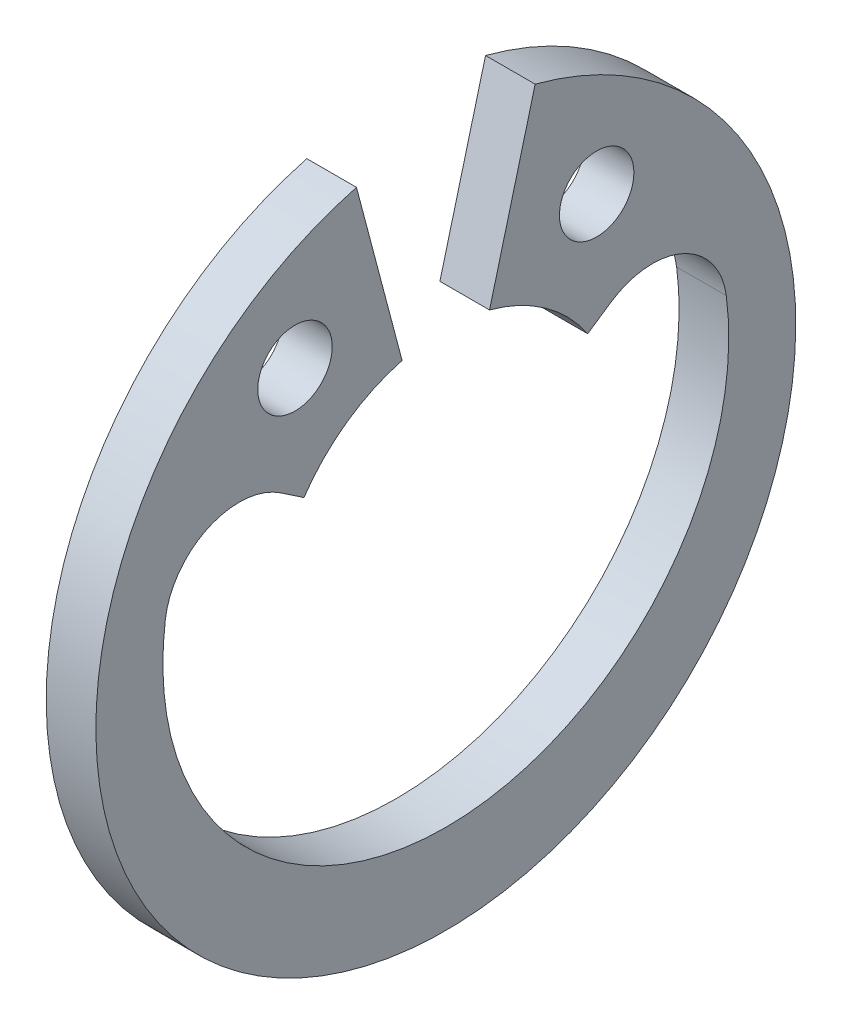
ISO-10303-21;
HEADER;
FILE_DESCRIPTION(('STEP AP214'),'2;1');
FILE_NAME('part.step','',(''),(''),'','','');
FILE_SCHEMA(('AUTOMOTIVE_DESIGN { 1 0 10303 214 1 1 1 1 }'));
ENDSEC;
DATA;
#1=APPLICATION_CONTEXT('core data for automotive mechanical design processes');
#2=APPLICATION_PROTOCOL_DEFINITION('international standard','automotive_design',2000,#1);
#3=PRODUCT_CONTEXT('',#1,'mechanical');
#4=PRODUCT('Part','Part','',(#3));
#5=PRODUCT_RELATED_PRODUCT_CATEGORY('part','',(#4));
#6=PRODUCT_DEFINITION_FORMATION('','',#4);
#7=PRODUCT_DEFINITION_CONTEXT('part definition',#1,'design');
#8=PRODUCT_DEFINITION('design','',#6,#7);
#9=PRODUCT_DEFINITION_SHAPE('','',#8);
#10=(LENGTH_UNIT() NAMED_UNIT(*) SI_UNIT(.MILLI.,.METRE.));
#11=(NAMED_UNIT(*) PLANE_ANGLE_UNIT() SI_UNIT($,.RADIAN.));
#12=(NAMED_UNIT(*) SI_UNIT($,.STERADIAN.) SOLID_ANGLE_UNIT());
#13=UNCERTAINTY_MEASURE_WITH_UNIT(LENGTH_MEASURE(1.E-05),#10,'distance_accuracy_value','');
#14=(GEOMETRIC_REPRESENTATION_CONTEXT(3) GLOBAL_UNCERTAINTY_ASSIGNED_CONTEXT((#13)) GLOBAL_UNIT_ASSIGNED_CONTEXT((#10,
#11,#12)) REPRESENTATION_CONTEXT('',''));
#15=CARTESIAN_POINT('',(0.,0.,0.));
#16=DIRECTION('',(0.,0.,1.));
#17=DIRECTION('',(1.,0.,0.));
#18=AXIS2_PLACEMENT_3D('',#15,#16,#17);
#19=CARTESIAN_POINT('',(0.,0.,0.));
#20=DIRECTION('',(1.,0.,0.));
#21=DIRECTION('',(0.,0.,-1.));
#22=AXIS2_PLACEMENT_3D('',#19,#20,#21);
#23=PLANE('',#22);
#24=DIRECTION('',(0.,0.966856831276746,0.25531914893617));
#25=VECTOR('',#24,1.);
#26=CARTESIAN_POINT('',(0.,3.33565606790477,0.880851063829788));
#27=LINE('',#26,#25);
#28=CARTESIAN_POINT('',(0.,3.33565606790477,0.880851063829787));
#29=VERTEX_POINT('',#28);
#30=CARTESIAN_POINT('',(0.,6.81634066050106,1.8));
#31=VERTEX_POINT('',#30);
#32=EDGE_CURVE('E119',#29,#31,#27,.T.);
#33=ORIENTED_EDGE('',*,*,#32,.F.);
#34=CARTESIAN_POINT('',(0.,0.,0.));
#35=DIRECTION('',(1.,0.,0.));
#36=DIRECTION('',(0.,0.,-1.));
#37=AXIS2_PLACEMENT_3D('',#34,#35,#36);
#38=CIRCLE('',#37,3.45);
#39=CARTESIAN_POINT('',(0.,1.93227251099613,2.85811527815949));
#40=VERTEX_POINT('',#39);
#41=EDGE_CURVE('E110',#29,#40,#38,.T.);
#42=ORIENTED_EDGE('',*,*,#41,.T.);
#43=DIRECTION('',(0.,-0.560078988694532,-0.828439211060722));
#44=VECTOR('',#43,1.);
#45=CARTESIAN_POINT('',(0.,2.24668654356718,3.32317988216597));
#46=LINE('',#45,#44);
#47=CARTESIAN_POINT('',(0.,2.24668654356718,3.32317988216598));
#48=VERTEX_POINT('',#47);
#49=EDGE_CURVE('E26',#48,#40,#46,.T.);
#50=ORIENTED_EDGE('',*,*,#49,.F.);
#51=CARTESIAN_POINT('',(0.,1.0040277269761,4.16329836520777));
#52=DIRECTION('',(1.,0.,0.));
#53=DIRECTION('',(0.,0.,-1.));
#54=AXIS2_PLACEMENT_3D('',#51,#52,#53);
#55=CIRCLE('',#54,1.5);
#56=CARTESIAN_POINT('',(0.,1.2018946887676,5.65019064961556));
#57=VERTEX_POINT('',#56);
#58=EDGE_CURVE('E138',#48,#57,#55,.T.);
#59=ORIENTED_EDGE('',*,*,#58,.T.);
#60=CARTESIAN_POINT('',(0.,0.45,0.));
#61=DIRECTION('',(1.,0.,0.));
#62=DIRECTION('',(0.,0.,-1.));
#63=AXIS2_PLACEMENT_3D('',#60,#61,#62);
#64=CIRCLE('',#63,5.7);
#65=CARTESIAN_POINT('',(0.,1.20189473614342,-5.65019064331106));
#66=VERTEX_POINT('',#65);
#67=EDGE_CURVE('E200',#57,#66,#64,.T.);
#68=ORIENTED_EDGE('',*,*,#67,.T.);
#69=CARTESIAN_POINT('',(0.,1.0040277269761,-4.16329836520777));
#70=DIRECTION('',(1.,0.,0.));
#71=DIRECTION('',(0.,0.,-1.));
#72=AXIS2_PLACEMENT_3D('',#69,#70,#71);
#73=CIRCLE('',#72,1.5);
#74=CARTESIAN_POINT('',(0.,2.24668654356718,-3.32317988216598));
#75=VERTEX_POINT('',#74);
#76=EDGE_CURVE('E153',#66,#75,#73,.T.);
#77=ORIENTED_EDGE('',*,*,#76,.T.);
#78=DIRECTION('',(0.,0.560078988694531,-0.828439211060722));
#79=VECTOR('',#78,1.);
#80=CARTESIAN_POINT('',(0.,1.93227251099613,-2.85811527815949));
#81=LINE('',#80,#79);
#82=CARTESIAN_POINT('',(0.,1.93227251099613,-2.85811527815949));
#83=VERTEX_POINT('',#82);
#84=EDGE_CURVE('E121',#83,#75,#81,.T.);
#85=ORIENTED_EDGE('',*,*,#84,.F.);
#86=CARTESIAN_POINT('',(0.,0.,0.));
#87=DIRECTION('',(1.,0.,0.));
#88=DIRECTION('',(0.,0.,-1.));
#89=AXIS2_PLACEMENT_3D('',#86,#87,#88);
#90=CIRCLE('',#89,3.45);
#91=CARTESIAN_POINT('',(0.,3.33565606790477,-0.880851063829787));
#92=VERTEX_POINT('',#91);
#93=EDGE_CURVE('E104',#83,#92,#90,.T.);
#94=ORIENTED_EDGE('',*,*,#93,.T.);
#95=DIRECTION('',(0.,-0.966856831276746,0.25531914893617));
#96=VECTOR('',#95,1.);
#97=CARTESIAN_POINT('',(0.,6.81634066050106,-1.8));
#98=LINE('',#97,#96);
#99=CARTESIAN_POINT('',(0.,6.81634066050106,-1.8));
#100=VERTEX_POINT('',#99);
#101=EDGE_CURVE('E94',#100,#92,#98,.T.);
#102=ORIENTED_EDGE('',*,*,#101,.F.);
#103=CARTESIAN_POINT('',(0.,0.,0.));
#104=DIRECTION('',(1.,0.,0.));
#105=DIRECTION('',(0.,0.,-1.));
#106=AXIS2_PLACEMENT_3D('',#103,#104,#105);
#107=CIRCLE('',#106,7.05);
#108=EDGE_CURVE('E128',#31,#100,#107,.T.);
#109=ORIENTED_EDGE('',*,*,#108,.F.);
#110=EDGE_LOOP('',(#33,#42,#50,#59,#68,#77,#85,#94,#102,#109));
#111=FACE_BOUND('',#110,.T.);
#112=CARTESIAN_POINT('',(0.,4.28124511921102,-3.03865763606758));
#113=DIRECTION('',(1.,0.,0.));
#114=DIRECTION('',(0.,0.,-1.));
#115=AXIS2_PLACEMENT_3D('',#112,#113,#114);
#116=CIRCLE('',#115,0.75);
#117=CARTESIAN_POINT('',(0.,4.28124511921102,-3.78865763606758));
#118=VERTEX_POINT('',#117);
#119=EDGE_CURVE('E11',#118,#118,#116,.T.);
#120=ORIENTED_EDGE('',*,*,#119,.T.);
#121=EDGE_LOOP('',(#120));
#122=FACE_BOUND('',#121,.T.);
#123=CARTESIAN_POINT('',(0.,4.28124511921102,3.03865763606758));
#124=DIRECTION('',(1.,0.,0.));
#125=DIRECTION('',(0.,0.,-1.));
#126=AXIS2_PLACEMENT_3D('',#123,#124,#125);
#127=CIRCLE('',#126,0.75);
#128=CARTESIAN_POINT('',(0.,4.28124511921102,2.28865763606758));
#129=VERTEX_POINT('',#128);
#130=EDGE_CURVE('E117',#129,#129,#127,.T.);
#131=ORIENTED_EDGE('',*,*,#130,.T.);
#132=EDGE_LOOP('',(#131));
#133=FACE_BOUND('',#132,.T.);
#134=ADVANCED_FACE('F16',(#111,#122,#133),#23,.F.);
#135=CARTESIAN_POINT('',(1.,4.28124511921102,-3.03865763606758));
#136=DIRECTION('',(-1.,0.,0.));
#137=DIRECTION('',(0.,0.,1.));
#138=AXIS2_PLACEMENT_3D('',#135,#136,#137);
#139=CYLINDRICAL_SURFACE('',#138,0.75);
#140=ORIENTED_EDGE('',*,*,#119,.F.);
#141=EDGE_LOOP('',(#140));
#142=FACE_BOUND('',#141,.T.);
#143=CARTESIAN_POINT('',(1.,4.28124511921102,-3.03865763606758));
#144=DIRECTION('',(1.,0.,0.));
#145=DIRECTION('',(0.,0.,-1.));
#146=AXIS2_PLACEMENT_3D('',#143,#144,#145);
#147=CIRCLE('',#146,0.75);
#148=CARTESIAN_POINT('',(1.,4.28124511921102,-3.78865763606758));
#149=VERTEX_POINT('',#148);
#150=EDGE_CURVE('E79',#149,#149,#147,.T.);
#151=ORIENTED_EDGE('',*,*,#150,.T.);
#152=EDGE_LOOP('',(#151));
#153=FACE_BOUND('',#152,.T.);
#154=ADVANCED_FACE('F227',(#142,#153),#139,.F.);
#155=CARTESIAN_POINT('',(1.,2.24668654356718,3.32317988216597));
#156=DIRECTION('',(0.,0.828439211060722,-0.560078988694532));
#157=DIRECTION('',(0.,0.560078988694532,0.828439211060722));
#158=AXIS2_PLACEMENT_3D('',#155,#156,#157);
#159=PLANE('',#158);
#160=ORIENTED_EDGE('',*,*,#49,.T.);
#161=DIRECTION('',(-1.,0.,0.));
#162=VECTOR('',#161,1.);
#163=CARTESIAN_POINT('',(1.,1.93227251099613,2.85811527815949));
#164=LINE('',#163,#162);
#165=CARTESIAN_POINT('',(1.,1.93227251099613,2.85811527815949));
#166=VERTEX_POINT('',#165);
#167=EDGE_CURVE('E80',#166,#40,#164,.T.);
#168=ORIENTED_EDGE('',*,*,#167,.F.);
#169=DIRECTION('',(0.,-0.560078988694532,-0.828439211060722));
#170=VECTOR('',#169,1.);
#171=CARTESIAN_POINT('',(1.,2.24668654356718,3.32317988216597));
#172=LINE('',#171,#170);
#173=CARTESIAN_POINT('',(1.,2.24668654356718,3.32317988216598));
#174=VERTEX_POINT('',#173);
#175=EDGE_CURVE('E120',#174,#166,#172,.T.);
#176=ORIENTED_EDGE('',*,*,#175,.F.);
#177=DIRECTION('',(-1.,0.,0.));
#178=VECTOR('',#177,1.);
#179=CARTESIAN_POINT('',(1.,2.24668654356718,3.32317988216598));
#180=LINE('',#179,#178);
#181=EDGE_CURVE('E135',#174,#48,#180,.T.);
#182=ORIENTED_EDGE('',*,*,#181,.T.);
#183=EDGE_LOOP('',(#160,#168,#176,#182));
#184=FACE_BOUND('',#183,.T.);
#185=ADVANCED_FACE('F18',(#184),#159,.F.);
#186=CARTESIAN_POINT('',(1.,1.0040277269761,4.16329836520777));
#187=DIRECTION('',(-1.,0.,0.));
#188=DIRECTION('',(0.,0.,1.));
#189=AXIS2_PLACEMENT_3D('',#186,#187,#188);
#190=CYLINDRICAL_SURFACE('',#189,1.5);
#191=ORIENTED_EDGE('',*,*,#58,.F.);
#192=ORIENTED_EDGE('',*,*,#181,.F.);
#193=CARTESIAN_POINT('',(1.,1.0040277269761,4.16329836520777));
#194=DIRECTION('',(1.,0.,0.));
#195=DIRECTION('',(0.,0.,-1.));
#196=AXIS2_PLACEMENT_3D('',#193,#194,#195);
#197=CIRCLE('',#196,1.5);
#198=CARTESIAN_POINT('',(1.,1.2018946887676,5.65019064961556));
#199=VERTEX_POINT('',#198);
#200=EDGE_CURVE('E116',#174,#199,#197,.T.);
#201=ORIENTED_EDGE('',*,*,#200,.T.);
#202=DIRECTION('',(-1.,0.,0.));
#203=VECTOR('',#202,1.);
#204=CARTESIAN_POINT('',(1.,1.2018946887676,5.65019064961556));
#205=LINE('',#204,#203);
#206=EDGE_CURVE('E141',#199,#57,#205,.T.);
#207=ORIENTED_EDGE('',*,*,#206,.T.);
#208=EDGE_LOOP('',(#191,#192,#201,#207));
#209=FACE_BOUND('',#208,.T.);
#210=ADVANCED_FACE('F208',(#209),#190,.F.);
#211=CARTESIAN_POINT('',(1.,0.45,0.));
#212=DIRECTION('',(-1.,0.,0.));
#213=DIRECTION('',(0.,0.,1.));
#214=AXIS2_PLACEMENT_3D('',#211,#212,#213);
#215=CYLINDRICAL_SURFACE('',#214,5.7);
#216=ORIENTED_EDGE('',*,*,#67,.F.);
#217=ORIENTED_EDGE('',*,*,#206,.F.);
#218=CARTESIAN_POINT('',(1.,0.45,0.));
#219=DIRECTION('',(1.,0.,0.));
#220=DIRECTION('',(0.,0.,-1.));
#221=AXIS2_PLACEMENT_3D('',#218,#219,#220);
#222=CIRCLE('',#221,5.7);
#223=CARTESIAN_POINT('',(1.,1.20189473614342,-5.65019064331106));
#224=VERTEX_POINT('',#223);
#225=EDGE_CURVE('E113',#199,#224,#222,.T.);
#226=ORIENTED_EDGE('',*,*,#225,.T.);
#227=DIRECTION('',(-1.,0.,0.));
#228=VECTOR('',#227,1.);
#229=CARTESIAN_POINT('',(1.,1.20189473614342,-5.65019064331106));
#230=LINE('',#229,#228);
#231=EDGE_CURVE('E20',#224,#66,#230,.T.);
#232=ORIENTED_EDGE('',*,*,#231,.T.);
#233=EDGE_LOOP('',(#216,#217,#226,#232));
#234=FACE_BOUND('',#233,.T.);
#235=ADVANCED_FACE('F202',(#234),#215,.F.);
#236=CARTESIAN_POINT('',(1.,1.0040277269761,-4.16329836520777));
#237=DIRECTION('',(-1.,0.,0.));
#238=DIRECTION('',(0.,0.,1.));
#239=AXIS2_PLACEMENT_3D('',#236,#237,#238);
#240=CYLINDRICAL_SURFACE('',#239,1.5);
#241=ORIENTED_EDGE('',*,*,#76,.F.);
#242=ORIENTED_EDGE('',*,*,#231,.F.);
#243=CARTESIAN_POINT('',(1.,1.0040277269761,-4.16329836520777));
#244=DIRECTION('',(1.,0.,0.));
#245=DIRECTION('',(0.,0.,-1.));
#246=AXIS2_PLACEMENT_3D('',#243,#244,#245);
#247=CIRCLE('',#246,1.5);
#248=CARTESIAN_POINT('',(1.,2.24668654356718,-3.32317988216598));
#249=VERTEX_POINT('',#248);
#250=EDGE_CURVE('E102',#224,#249,#247,.T.);
#251=ORIENTED_EDGE('',*,*,#250,.T.);
#252=DIRECTION('',(-1.,0.,0.));
#253=VECTOR('',#252,1.);
#254=CARTESIAN_POINT('',(1.,2.24668654356718,-3.32317988216598));
#255=LINE('',#254,#253);
#256=EDGE_CURVE('E124',#249,#75,#255,.T.);
#257=ORIENTED_EDGE('',*,*,#256,.T.);
#258=EDGE_LOOP('',(#241,#242,#251,#257));
#259=FACE_BOUND('',#258,.T.);
#260=ADVANCED_FACE('F205',(#259),#240,.F.);
#261=CARTESIAN_POINT('',(1.,1.93227251099613,-2.85811527815949));
#262=DIRECTION('',(0.,0.828439211060722,0.560078988694531));
#263=DIRECTION('',(0.,-0.560078988694531,0.828439211060722));
#264=AXIS2_PLACEMENT_3D('',#261,#262,#263);
#265=PLANE('',#264);
#266=ORIENTED_EDGE('',*,*,#84,.T.);
#267=ORIENTED_EDGE('',*,*,#256,.F.);
#268=DIRECTION('',(0.,0.560078988694531,-0.828439211060722));
#269=VECTOR('',#268,1.);
#270=CARTESIAN_POINT('',(1.,1.93227251099613,-2.85811527815949));
#271=LINE('',#270,#269);
#272=CARTESIAN_POINT('',(1.,1.93227251099613,-2.85811527815949));
#273=VERTEX_POINT('',#272);
#274=EDGE_CURVE('E99',#273,#249,#271,.T.);
#275=ORIENTED_EDGE('',*,*,#274,.F.);
#276=DIRECTION('',(-1.,0.,0.));
#277=VECTOR('',#276,1.);
#278=CARTESIAN_POINT('',(1.,1.93227251099613,-2.85811527815949));
#279=LINE('',#278,#277);
#280=EDGE_CURVE('E106',#273,#83,#279,.T.);
#281=ORIENTED_EDGE('',*,*,#280,.T.);
#282=EDGE_LOOP('',(#266,#267,#275,#281));
#283=FACE_BOUND('',#282,.T.);
#284=ADVANCED_FACE('F177',(#283),#265,.F.);
#285=CARTESIAN_POINT('',(1.,0.,0.));
#286=DIRECTION('',(-1.,0.,0.));
#287=DIRECTION('',(0.,0.,1.));
#288=AXIS2_PLACEMENT_3D('',#285,#286,#287);
#289=CYLINDRICAL_SURFACE('',#288,3.45);
#290=ORIENTED_EDGE('',*,*,#93,.F.);
#291=ORIENTED_EDGE('',*,*,#280,.F.);
#292=CARTESIAN_POINT('',(1.,0.,0.));
#293=DIRECTION('',(1.,0.,0.));
#294=DIRECTION('',(0.,0.,-1.));
#295=AXIS2_PLACEMENT_3D('',#292,#293,#294);
#296=CIRCLE('',#295,3.45);
#297=CARTESIAN_POINT('',(1.,3.33565606790477,-0.880851063829787));
#298=VERTEX_POINT('',#297);
#299=EDGE_CURVE('E103',#273,#298,#296,.T.);
#300=ORIENTED_EDGE('',*,*,#299,.T.);
#301=DIRECTION('',(-1.,0.,0.));
#302=VECTOR('',#301,1.);
#303=CARTESIAN_POINT('',(1.,3.33565606790477,-0.880851063829787));
#304=LINE('',#303,#302);
#305=EDGE_CURVE('E97',#298,#92,#304,.T.);
#306=ORIENTED_EDGE('',*,*,#305,.T.);
#307=EDGE_LOOP('',(#290,#291,#300,#306));
#308=FACE_BOUND('',#307,.T.);
#309=ADVANCED_FACE('F163',(#308),#289,.F.);
#310=CARTESIAN_POINT('',(1.,6.81634066050106,-1.8));
#311=DIRECTION('',(0.,-0.25531914893617,-0.966856831276746));
#312=DIRECTION('',(0.,0.966856831276746,-0.25531914893617));
#313=AXIS2_PLACEMENT_3D('',#310,#311,#312);
#314=PLANE('',#313);
#315=ORIENTED_EDGE('',*,*,#101,.T.);
#316=ORIENTED_EDGE('',*,*,#305,.F.);
#317=DIRECTION('',(0.,-0.966856831276746,0.25531914893617));
#318=VECTOR('',#317,1.);
#319=CARTESIAN_POINT('',(1.,6.81634066050106,-1.8));
#320=LINE('',#319,#318);
#321=CARTESIAN_POINT('',(1.,6.81634066050106,-1.8));
#322=VERTEX_POINT('',#321);
#323=EDGE_CURVE('E93',#322,#298,#320,.T.);
#324=ORIENTED_EDGE('',*,*,#323,.F.);
#325=DIRECTION('',(-1.,0.,0.));
#326=VECTOR('',#325,1.);
#327=CARTESIAN_POINT('',(1.,6.81634066050106,-1.8));
#328=LINE('',#327,#326);
#329=EDGE_CURVE('E98',#322,#100,#328,.T.);
#330=ORIENTED_EDGE('',*,*,#329,.T.);
#331=EDGE_LOOP('',(#315,#316,#324,#330));
#332=FACE_BOUND('',#331,.T.);
#333=ADVANCED_FACE('F169',(#332),#314,.F.);
#334=CARTESIAN_POINT('',(1.,0.,0.));
#335=DIRECTION('',(-1.,0.,0.));
#336=DIRECTION('',(0.,0.,1.));
#337=AXIS2_PLACEMENT_3D('',#334,#335,#336);
#338=CYLINDRICAL_SURFACE('',#337,7.05);
#339=ORIENTED_EDGE('',*,*,#108,.T.);
#340=ORIENTED_EDGE('',*,*,#329,.F.);
#341=CARTESIAN_POINT('',(1.,0.,0.));
#342=DIRECTION('',(1.,0.,0.));
#343=DIRECTION('',(0.,0.,-1.));
#344=AXIS2_PLACEMENT_3D('',#341,#342,#343);
#345=CIRCLE('',#344,7.05);
#346=CARTESIAN_POINT('',(1.,6.81634066050106,1.8));
#347=VERTEX_POINT('',#346);
#348=EDGE_CURVE('E90',#347,#322,#345,.T.);
#349=ORIENTED_EDGE('',*,*,#348,.F.);
#350=DIRECTION('',(-1.,0.,0.));
#351=VECTOR('',#350,1.);
#352=CARTESIAN_POINT('',(1.,6.81634066050106,1.8));
#353=LINE('',#352,#351);
#354=EDGE_CURVE('E125',#347,#31,#353,.T.);
#355=ORIENTED_EDGE('',*,*,#354,.T.);
#356=EDGE_LOOP('',(#339,#340,#349,#355));
#357=FACE_BOUND('',#356,.T.);
#358=ADVANCED_FACE('F217',(#357),#338,.T.);
#359=CARTESIAN_POINT('',(1.,3.33565606790477,0.880851063829788));
#360=DIRECTION('',(0.,-0.25531914893617,0.966856831276746));
#361=DIRECTION('',(0.,-0.966856831276746,-0.25531914893617));
#362=AXIS2_PLACEMENT_3D('',#359,#360,#361);
#363=PLANE('',#362);
#364=ORIENTED_EDGE('',*,*,#32,.T.);
#365=ORIENTED_EDGE('',*,*,#354,.F.);
#366=DIRECTION('',(0.,0.966856831276746,0.25531914893617));
#367=VECTOR('',#366,1.);
#368=CARTESIAN_POINT('',(1.,3.33565606790477,0.880851063829788));
#369=LINE('',#368,#367);
#370=CARTESIAN_POINT('',(1.,3.33565606790477,0.880851063829787));
#371=VERTEX_POINT('',#370);
#372=EDGE_CURVE('E82',#371,#347,#369,.T.);
#373=ORIENTED_EDGE('',*,*,#372,.F.);
#374=DIRECTION('',(-1.,0.,0.));
#375=VECTOR('',#374,1.);
#376=CARTESIAN_POINT('',(1.,3.33565606790477,0.880851063829787));
#377=LINE('',#376,#375);
#378=EDGE_CURVE('E107',#371,#29,#377,.T.);
#379=ORIENTED_EDGE('',*,*,#378,.T.);
#380=EDGE_LOOP('',(#364,#365,#373,#379));
#381=FACE_BOUND('',#380,.T.);
#382=ADVANCED_FACE('F219',(#381),#363,.F.);
#383=CARTESIAN_POINT('',(1.,4.28124511921102,3.03865763606758));
#384=DIRECTION('',(-1.,0.,0.));
#385=DIRECTION('',(0.,0.,1.));
#386=AXIS2_PLACEMENT_3D('',#383,#384,#385);
#387=CYLINDRICAL_SURFACE('',#386,0.75);
#388=ORIENTED_EDGE('',*,*,#130,.F.);
#389=EDGE_LOOP('',(#388));
#390=FACE_BOUND('',#389,.T.);
#391=CARTESIAN_POINT('',(1.,4.28124511921102,3.03865763606758));
#392=DIRECTION('',(1.,0.,0.));
#393=DIRECTION('',(0.,0.,-1.));
#394=AXIS2_PLACEMENT_3D('',#391,#392,#393);
#395=CIRCLE('',#394,0.75);
#396=CARTESIAN_POINT('',(1.,4.28124511921102,2.28865763606758));
#397=VERTEX_POINT('',#396);
#398=EDGE_CURVE('E76',#397,#397,#395,.T.);
#399=ORIENTED_EDGE('',*,*,#398,.T.);
#400=EDGE_LOOP('',(#399));
#401=FACE_BOUND('',#400,.T.);
#402=ADVANCED_FACE('F77',(#390,#401),#387,.F.);
#403=CARTESIAN_POINT('',(1.,0.,0.));
#404=DIRECTION('',(1.,0.,0.));
#405=DIRECTION('',(0.,0.,-1.));
#406=AXIS2_PLACEMENT_3D('',#403,#404,#405);
#407=PLANE('',#406);
#408=ORIENTED_EDGE('',*,*,#372,.T.);
#409=ORIENTED_EDGE('',*,*,#348,.T.);
#410=ORIENTED_EDGE('',*,*,#323,.T.);
#411=ORIENTED_EDGE('',*,*,#299,.F.);
#412=ORIENTED_EDGE('',*,*,#274,.T.);
#413=ORIENTED_EDGE('',*,*,#250,.F.);
#414=ORIENTED_EDGE('',*,*,#225,.F.);
#415=ORIENTED_EDGE('',*,*,#200,.F.);
#416=ORIENTED_EDGE('',*,*,#175,.T.);
#417=CARTESIAN_POINT('',(1.,0.,0.));
#418=DIRECTION('',(1.,0.,0.));
#419=DIRECTION('',(0.,0.,-1.));
#420=AXIS2_PLACEMENT_3D('',#417,#418,#419);
#421=CIRCLE('',#420,3.45);
#422=EDGE_CURVE('E85',#371,#166,#421,.T.);
#423=ORIENTED_EDGE('',*,*,#422,.F.);
#424=EDGE_LOOP('',(#408,#409,#410,#411,#412,#413,#414,#415,#416,#423));
#425=FACE_BOUND('',#424,.T.);
#426=ORIENTED_EDGE('',*,*,#150,.F.);
#427=EDGE_LOOP('',(#426));
#428=FACE_BOUND('',#427,.T.);
#429=ORIENTED_EDGE('',*,*,#398,.F.);
#430=EDGE_LOOP('',(#429));
#431=FACE_BOUND('',#430,.T.);
#432=ADVANCED_FACE('F212',(#425,#428,#431),#407,.T.);
#433=CARTESIAN_POINT('',(1.,0.,0.));
#434=DIRECTION('',(-1.,0.,0.));
#435=DIRECTION('',(0.,0.,1.));
#436=AXIS2_PLACEMENT_3D('',#433,#434,#435);
#437=CYLINDRICAL_SURFACE('',#436,3.45);
#438=ORIENTED_EDGE('',*,*,#41,.F.);
#439=ORIENTED_EDGE('',*,*,#378,.F.);
#440=ORIENTED_EDGE('',*,*,#422,.T.);
#441=ORIENTED_EDGE('',*,*,#167,.T.);
#442=EDGE_LOOP('',(#438,#439,#440,#441));
#443=FACE_BOUND('',#442,.T.);
#444=ADVANCED_FACE('F223',(#443),#437,.F.);
#445=CLOSED_SHELL('',(#134,#154,#185,#210,#235,#260,#284,#309,#333,#358,#382,#402,#432,#444));
#446=MANIFOLD_SOLID_BREP('B1',#445);
#447=ADVANCED_BREP_SHAPE_REPRESENTATION('',(#18,#446),#14);
#448=SHAPE_DEFINITION_REPRESENTATION(#9,#447);
ENDSEC;
END-ISO-10303-21;
